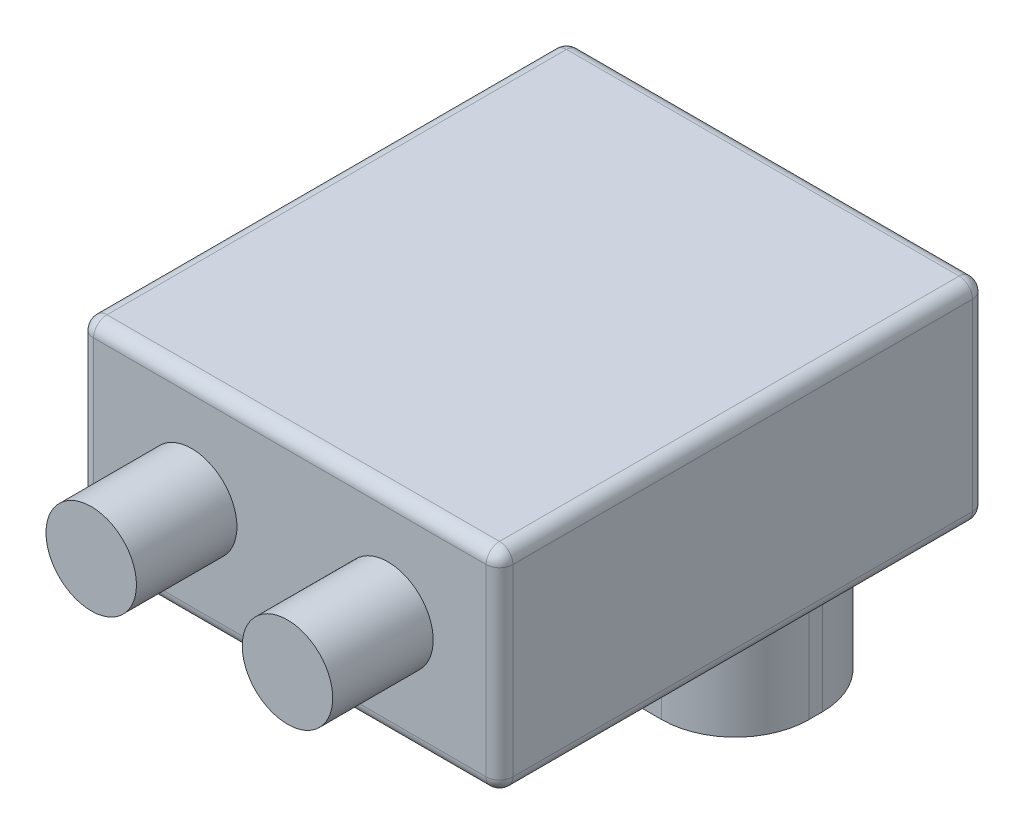
ISO-10303-21;
HEADER;
FILE_DESCRIPTION(('STEP AP214'),'2;1');
FILE_NAME('part.step','',(''),(''),'','','');
FILE_SCHEMA(('AUTOMOTIVE_DESIGN { 1 0 10303 214 1 1 1 1 }'));
ENDSEC;
DATA;
#1=APPLICATION_CONTEXT('core data for automotive mechanical design processes');
#2=APPLICATION_PROTOCOL_DEFINITION('international standard','automotive_design',2000,#1);
#3=PRODUCT_CONTEXT('',#1,'mechanical');
#4=PRODUCT('Part','Part','',(#3));
#5=PRODUCT_RELATED_PRODUCT_CATEGORY('part','',(#4));
#6=PRODUCT_DEFINITION_FORMATION('','',#4);
#7=PRODUCT_DEFINITION_CONTEXT('part definition',#1,'design');
#8=PRODUCT_DEFINITION('design','',#6,#7);
#9=PRODUCT_DEFINITION_SHAPE('','',#8);
#10=(LENGTH_UNIT() NAMED_UNIT(*) SI_UNIT(.MILLI.,.METRE.));
#11=(NAMED_UNIT(*) PLANE_ANGLE_UNIT() SI_UNIT($,.RADIAN.));
#12=(NAMED_UNIT(*) SI_UNIT($,.STERADIAN.) SOLID_ANGLE_UNIT());
#13=UNCERTAINTY_MEASURE_WITH_UNIT(LENGTH_MEASURE(1.E-05),#10,'distance_accuracy_value','');
#14=(GEOMETRIC_REPRESENTATION_CONTEXT(3) GLOBAL_UNCERTAINTY_ASSIGNED_CONTEXT((#13)) GLOBAL_UNIT_ASSIGNED_CONTEXT((#10,
#11,#12)) REPRESENTATION_CONTEXT('',''));
#15=CARTESIAN_POINT('',(0.,0.,0.));
#16=DIRECTION('',(0.,0.,1.));
#17=DIRECTION('',(1.,0.,0.));
#18=AXIS2_PLACEMENT_3D('',#15,#16,#17);
#19=CARTESIAN_POINT('',(0.,0.,0.));
#20=DIRECTION('',(0.,1.,0.));
#21=DIRECTION('',(0.,0.,1.));
#22=AXIS2_PLACEMENT_3D('',#19,#20,#21);
#23=PLANE('',#22);
#24=DIRECTION('',(-1.,0.,0.));
#25=VECTOR('',#24,1.);
#26=CARTESIAN_POINT('',(0.,0.,-34.3));
#27=LINE('',#26,#25);
#28=CARTESIAN_POINT('',(-29.3,0.,-34.3));
#29=VERTEX_POINT('',#28);
#30=CARTESIAN_POINT('',(29.3,0.,-34.3));
#31=VERTEX_POINT('',#30);
#32=EDGE_CURVE('E245',#29,#31,#27,.F.);
#33=ORIENTED_EDGE('',*,*,#32,.T.);
#34=DIRECTION('',(0.,0.,-1.));
#35=VECTOR('',#34,1.);
#36=CARTESIAN_POINT('',(29.3,0.,0.));
#37=LINE('',#36,#35);
#38=CARTESIAN_POINT('',(29.3,0.,34.3));
#39=VERTEX_POINT('',#38);
#40=EDGE_CURVE('E248',#31,#39,#37,.F.);
#41=ORIENTED_EDGE('',*,*,#40,.T.);
#42=DIRECTION('',(1.,0.,0.));
#43=VECTOR('',#42,1.);
#44=CARTESIAN_POINT('',(0.,0.,34.3));
#45=LINE('',#44,#43);
#46=CARTESIAN_POINT('',(-29.3,0.,34.3));
#47=VERTEX_POINT('',#46);
#48=EDGE_CURVE('E243',#39,#47,#45,.F.);
#49=ORIENTED_EDGE('',*,*,#48,.T.);
#50=DIRECTION('',(0.,0.,1.));
#51=VECTOR('',#50,1.);
#52=CARTESIAN_POINT('',(-29.3,0.,0.));
#53=LINE('',#52,#51);
#54=EDGE_CURVE('E241',#47,#29,#53,.F.);
#55=ORIENTED_EDGE('',*,*,#54,.T.);
#56=EDGE_LOOP('',(#33,#41,#49,#55));
#57=FACE_BOUND('',#56,.T.);
#58=DIRECTION('',(0.,0.,-1.));
#59=VECTOR('',#58,1.);
#60=CARTESIAN_POINT('',(-25.,0.,-5.2));
#61=LINE('',#60,#59);
#62=CARTESIAN_POINT('',(-25.,0.,-16.2));
#63=VERTEX_POINT('',#62);
#64=CARTESIAN_POINT('',(-25.,0.,-18.2));
#65=VERTEX_POINT('',#64);
#66=EDGE_CURVE('E317',#63,#65,#61,.T.);
#67=ORIENTED_EDGE('',*,*,#66,.F.);
#68=CARTESIAN_POINT('',(-14.,0.,-16.2));
#69=DIRECTION('',(0.,1.,0.));
#70=DIRECTION('',(0.,0.,1.));
#71=AXIS2_PLACEMENT_3D('',#68,#69,#70);
#72=CIRCLE('',#71,11.);
#73=CARTESIAN_POINT('',(-14.,0.,-5.2));
#74=VERTEX_POINT('',#73);
#75=EDGE_CURVE('E59',#63,#74,#72,.T.);
#76=ORIENTED_EDGE('',*,*,#75,.T.);
#77=DIRECTION('',(-1.,0.,0.));
#78=VECTOR('',#77,1.);
#79=CARTESIAN_POINT('',(-25.,0.,-5.2));
#80=LINE('',#79,#78);
#81=CARTESIAN_POINT('',(14.,0.,-5.2));
#82=VERTEX_POINT('',#81);
#83=EDGE_CURVE('E799',#82,#74,#80,.T.);
#84=ORIENTED_EDGE('',*,*,#83,.F.);
#85=CARTESIAN_POINT('',(14.,0.,-16.2));
#86=DIRECTION('',(0.,1.,0.));
#87=DIRECTION('',(0.,0.,1.));
#88=AXIS2_PLACEMENT_3D('',#85,#86,#87);
#89=CIRCLE('',#88,11.);
#90=CARTESIAN_POINT('',(25.,0.,-16.2));
#91=VERTEX_POINT('',#90);
#92=EDGE_CURVE('E344',#82,#91,#89,.T.);
#93=ORIENTED_EDGE('',*,*,#92,.T.);
#94=DIRECTION('',(0.,0.,1.));
#95=VECTOR('',#94,1.);
#96=CARTESIAN_POINT('',(25.,0.,-5.2));
#97=LINE('',#96,#95);
#98=CARTESIAN_POINT('',(25.,0.,-18.2));
#99=VERTEX_POINT('',#98);
#100=EDGE_CURVE('E806',#99,#91,#97,.T.);
#101=ORIENTED_EDGE('',*,*,#100,.F.);
#102=CARTESIAN_POINT('',(14.,0.,-18.2));
#103=DIRECTION('',(0.,1.,0.));
#104=DIRECTION('',(0.,0.,1.));
#105=AXIS2_PLACEMENT_3D('',#102,#103,#104);
#106=CIRCLE('',#105,11.);
#107=CARTESIAN_POINT('',(14.,0.,-29.2));
#108=VERTEX_POINT('',#107);
#109=EDGE_CURVE('E346',#99,#108,#106,.T.);
#110=ORIENTED_EDGE('',*,*,#109,.T.);
#111=DIRECTION('',(1.,0.,0.));
#112=VECTOR('',#111,1.);
#113=CARTESIAN_POINT('',(-25.,0.,-29.2));
#114=LINE('',#113,#112);
#115=CARTESIAN_POINT('',(-14.,0.,-29.2));
#116=VERTEX_POINT('',#115);
#117=EDGE_CURVE('E784',#116,#108,#114,.T.);
#118=ORIENTED_EDGE('',*,*,#117,.F.);
#119=CARTESIAN_POINT('',(-14.,0.,-18.2));
#120=DIRECTION('',(0.,1.,0.));
#121=DIRECTION('',(0.,0.,1.));
#122=AXIS2_PLACEMENT_3D('',#119,#120,#121);
#123=CIRCLE('',#122,11.);
#124=EDGE_CURVE('E51',#116,#65,#123,.T.);
#125=ORIENTED_EDGE('',*,*,#124,.T.);
#126=EDGE_LOOP('',(#67,#76,#84,#93,#101,#110,#118,#125));
#127=FACE_BOUND('',#126,.T.);
#128=ADVANCED_FACE('F36',(#57,#127),#23,.F.);
#129=CARTESIAN_POINT('',(31.3,24.14,-36.3));
#130=DIRECTION('',(-1.,0.,0.));
#131=DIRECTION('',(0.,0.,1.));
#132=AXIS2_PLACEMENT_3D('',#129,#130,#131);
#133=PLANE('',#132);
#134=DIRECTION('',(0.,-1.,0.));
#135=VECTOR('',#134,1.);
#136=CARTESIAN_POINT('',(31.3,24.14,34.3));
#137=LINE('',#136,#135);
#138=CARTESIAN_POINT('',(31.3,29.44,34.3));
#139=VERTEX_POINT('',#138);
#140=CARTESIAN_POINT('',(31.3,2.,34.3));
#141=VERTEX_POINT('',#140);
#142=EDGE_CURVE('E214',#139,#141,#137,.T.);
#143=ORIENTED_EDGE('',*,*,#142,.T.);
#144=DIRECTION('',(0.,0.,-1.));
#145=VECTOR('',#144,1.);
#146=CARTESIAN_POINT('',(31.3,2.,-36.3));
#147=LINE('',#146,#145);
#148=CARTESIAN_POINT('',(31.3,2.,-34.3));
#149=VERTEX_POINT('',#148);
#150=EDGE_CURVE('E221',#141,#149,#147,.T.);
#151=ORIENTED_EDGE('',*,*,#150,.T.);
#152=DIRECTION('',(0.,-1.,0.));
#153=VECTOR('',#152,1.);
#154=CARTESIAN_POINT('',(31.3,24.14,-34.3));
#155=LINE('',#154,#153);
#156=CARTESIAN_POINT('',(31.3,29.44,-34.3));
#157=VERTEX_POINT('',#156);
#158=EDGE_CURVE('E182',#149,#157,#155,.F.);
#159=ORIENTED_EDGE('',*,*,#158,.T.);
#160=DIRECTION('',(0.,0.,-1.));
#161=VECTOR('',#160,1.);
#162=CARTESIAN_POINT('',(31.3,29.44,36.3));
#163=LINE('',#162,#161);
#164=EDGE_CURVE('E212',#157,#139,#163,.F.);
#165=ORIENTED_EDGE('',*,*,#164,.T.);
#166=EDGE_LOOP('',(#143,#151,#159,#165));
#167=FACE_BOUND('',#166,.T.);
#168=ADVANCED_FACE('F438',(#167),#133,.F.);
#169=CARTESIAN_POINT('',(-31.3,24.14,-36.3));
#170=DIRECTION('',(0.,0.,1.));
#171=DIRECTION('',(1.,0.,0.));
#172=AXIS2_PLACEMENT_3D('',#169,#170,#171);
#173=PLANE('',#172);
#174=DIRECTION('',(-1.,0.,0.));
#175=VECTOR('',#174,1.);
#176=CARTESIAN_POINT('',(31.3,29.44,-36.3));
#177=LINE('',#176,#175);
#178=CARTESIAN_POINT('',(-29.3,29.44,-36.3));
#179=VERTEX_POINT('',#178);
#180=CARTESIAN_POINT('',(29.3,29.44,-36.3));
#181=VERTEX_POINT('',#180);
#182=EDGE_CURVE('E210',#179,#181,#177,.F.);
#183=ORIENTED_EDGE('',*,*,#182,.T.);
#184=DIRECTION('',(0.,-1.,0.));
#185=VECTOR('',#184,1.);
#186=CARTESIAN_POINT('',(29.3,24.14,-36.3));
#187=LINE('',#186,#185);
#188=CARTESIAN_POINT('',(29.3,2.,-36.3));
#189=VERTEX_POINT('',#188);
#190=EDGE_CURVE('E180',#181,#189,#187,.T.);
#191=ORIENTED_EDGE('',*,*,#190,.T.);
#192=DIRECTION('',(-1.,0.,0.));
#193=VECTOR('',#192,1.);
#194=CARTESIAN_POINT('',(-31.3,2.,-36.3));
#195=LINE('',#194,#193);
#196=CARTESIAN_POINT('',(-29.3,2.,-36.3));
#197=VERTEX_POINT('',#196);
#198=EDGE_CURVE('E199',#189,#197,#195,.T.);
#199=ORIENTED_EDGE('',*,*,#198,.T.);
#200=DIRECTION('',(0.,-1.,0.));
#201=VECTOR('',#200,1.);
#202=CARTESIAN_POINT('',(-29.3,24.14,-36.3));
#203=LINE('',#202,#201);
#204=EDGE_CURVE('E205',#197,#179,#203,.F.);
#205=ORIENTED_EDGE('',*,*,#204,.T.);
#206=EDGE_LOOP('',(#183,#191,#199,#205));
#207=FACE_BOUND('',#206,.T.);
#208=ADVANCED_FACE('F208',(#207),#173,.F.);
#209=CARTESIAN_POINT('',(-31.3,24.14,-36.3));
#210=DIRECTION('',(1.,0.,0.));
#211=DIRECTION('',(0.,0.,-1.));
#212=AXIS2_PLACEMENT_3D('',#209,#210,#211);
#213=PLANE('',#212);
#214=DIRECTION('',(0.,-1.,0.));
#215=VECTOR('',#214,1.);
#216=CARTESIAN_POINT('',(-31.3,24.14,-34.3));
#217=LINE('',#216,#215);
#218=CARTESIAN_POINT('',(-31.3,29.44,-34.3));
#219=VERTEX_POINT('',#218);
#220=CARTESIAN_POINT('',(-31.3,2.,-34.3));
#221=VERTEX_POINT('',#220);
#222=EDGE_CURVE('E236',#219,#221,#217,.T.);
#223=ORIENTED_EDGE('',*,*,#222,.T.);
#224=DIRECTION('',(0.,0.,1.));
#225=VECTOR('',#224,1.);
#226=CARTESIAN_POINT('',(-31.3,2.,-36.3));
#227=LINE('',#226,#225);
#228=CARTESIAN_POINT('',(-31.3,2.,34.3));
#229=VERTEX_POINT('',#228);
#230=EDGE_CURVE('E239',#221,#229,#227,.T.);
#231=ORIENTED_EDGE('',*,*,#230,.T.);
#232=DIRECTION('',(0.,-1.,0.));
#233=VECTOR('',#232,1.);
#234=CARTESIAN_POINT('',(-31.3,24.14,34.3));
#235=LINE('',#234,#233);
#236=CARTESIAN_POINT('',(-31.3,29.44,34.3));
#237=VERTEX_POINT('',#236);
#238=EDGE_CURVE('E234',#229,#237,#235,.F.);
#239=ORIENTED_EDGE('',*,*,#238,.T.);
#240=DIRECTION('',(0.,0.,1.));
#241=VECTOR('',#240,1.);
#242=CARTESIAN_POINT('',(-31.3,29.44,-36.3));
#243=LINE('',#242,#241);
#244=EDGE_CURVE('E232',#237,#219,#243,.F.);
#245=ORIENTED_EDGE('',*,*,#244,.T.);
#246=EDGE_LOOP('',(#223,#231,#239,#245));
#247=FACE_BOUND('',#246,.T.);
#248=ADVANCED_FACE('F358',(#247),#213,.F.);
#249=CARTESIAN_POINT('',(-31.3,24.14,36.3));
#250=DIRECTION('',(0.,0.,-1.));
#251=DIRECTION('',(-1.,0.,0.));
#252=AXIS2_PLACEMENT_3D('',#249,#250,#251);
#253=PLANE('',#252);
#254=CARTESIAN_POINT('',(14.64999991,15.7200005,36.3));
#255=DIRECTION('',(0.,0.,-1.));
#256=DIRECTION('',(-1.,0.,0.));
#257=AXIS2_PLACEMENT_3D('',#254,#255,#256);
#258=CIRCLE('',#257,6.75);
#259=CARTESIAN_POINT('',(7.89999991,15.7200005,36.3));
#260=VERTEX_POINT('',#259);
#261=EDGE_CURVE('E11',#260,#260,#258,.F.);
#262=ORIENTED_EDGE('',*,*,#261,.F.);
#263=EDGE_LOOP('',(#262));
#264=FACE_BOUND('',#263,.T.);
#265=CARTESIAN_POINT('',(-14.64999991,15.7200005,36.3));
#266=DIRECTION('',(0.,0.,-1.));
#267=DIRECTION('',(-1.,0.,0.));
#268=AXIS2_PLACEMENT_3D('',#265,#266,#267);
#269=CIRCLE('',#268,6.75);
#270=CARTESIAN_POINT('',(-21.39999991,15.7200005,36.3));
#271=VERTEX_POINT('',#270);
#272=EDGE_CURVE('E44',#271,#271,#269,.F.);
#273=ORIENTED_EDGE('',*,*,#272,.F.);
#274=EDGE_LOOP('',(#273));
#275=FACE_BOUND('',#274,.T.);
#276=DIRECTION('',(1.,0.,0.));
#277=VECTOR('',#276,1.);
#278=CARTESIAN_POINT('',(-31.3,29.44,36.3));
#279=LINE('',#278,#277);
#280=CARTESIAN_POINT('',(29.3,29.44,36.3));
#281=VERTEX_POINT('',#280);
#282=CARTESIAN_POINT('',(-29.3,29.44,36.3));
#283=VERTEX_POINT('',#282);
#284=EDGE_CURVE('E254',#281,#283,#279,.F.);
#285=ORIENTED_EDGE('',*,*,#284,.T.);
#286=DIRECTION('',(0.,-1.,0.));
#287=VECTOR('',#286,1.);
#288=CARTESIAN_POINT('',(-29.3,24.14,36.3));
#289=LINE('',#288,#287);
#290=CARTESIAN_POINT('',(-29.3,2.,36.3));
#291=VERTEX_POINT('',#290);
#292=EDGE_CURVE('E256',#283,#291,#289,.T.);
#293=ORIENTED_EDGE('',*,*,#292,.T.);
#294=DIRECTION('',(1.,0.,0.));
#295=VECTOR('',#294,1.);
#296=CARTESIAN_POINT('',(-31.3,2.,36.3));
#297=LINE('',#296,#295);
#298=CARTESIAN_POINT('',(29.3,2.,36.3));
#299=VERTEX_POINT('',#298);
#300=EDGE_CURVE('E250',#291,#299,#297,.T.);
#301=ORIENTED_EDGE('',*,*,#300,.T.);
#302=DIRECTION('',(0.,-1.,0.));
#303=VECTOR('',#302,1.);
#304=CARTESIAN_POINT('',(29.3,24.14,36.3));
#305=LINE('',#304,#303);
#306=EDGE_CURVE('E252',#299,#281,#305,.F.);
#307=ORIENTED_EDGE('',*,*,#306,.T.);
#308=EDGE_LOOP('',(#285,#293,#301,#307));
#309=FACE_BOUND('',#308,.T.);
#310=ADVANCED_FACE('F354',(#264,#275,#309),#253,.F.);
#311=CARTESIAN_POINT('',(-25.,-19.,-5.2));
#312=DIRECTION('',(1.,0.,0.));
#313=DIRECTION('',(0.,0.,-1.));
#314=AXIS2_PLACEMENT_3D('',#311,#312,#313);
#315=PLANE('',#314);
#316=ORIENTED_EDGE('',*,*,#66,.T.);
#317=DIRECTION('',(0.,1.,0.));
#318=VECTOR('',#317,1.);
#319=CARTESIAN_POINT('',(-25.,-19.,-18.2));
#320=LINE('',#319,#318);
#321=CARTESIAN_POINT('',(-25.,-19.,-18.2));
#322=VERTEX_POINT('',#321);
#323=EDGE_CURVE('E342',#65,#322,#320,.F.);
#324=ORIENTED_EDGE('',*,*,#323,.T.);
#325=DIRECTION('',(0.,0.,-1.));
#326=VECTOR('',#325,1.);
#327=CARTESIAN_POINT('',(-25.,-19.,-5.2));
#328=LINE('',#327,#326);
#329=CARTESIAN_POINT('',(-25.,-19.,-16.2));
#330=VERTEX_POINT('',#329);
#331=EDGE_CURVE('E793',#330,#322,#328,.T.);
#332=ORIENTED_EDGE('',*,*,#331,.F.);
#333=DIRECTION('',(0.,1.,0.));
#334=VECTOR('',#333,1.);
#335=CARTESIAN_POINT('',(-25.,-19.,-16.2));
#336=LINE('',#335,#334);
#337=EDGE_CURVE('E340',#330,#63,#336,.T.);
#338=ORIENTED_EDGE('',*,*,#337,.T.);
#339=EDGE_LOOP('',(#316,#324,#332,#338));
#340=FACE_BOUND('',#339,.T.);
#341=ADVANCED_FACE('F357',(#340),#315,.F.);
#342=CARTESIAN_POINT('',(-25.,-19.,-29.2));
#343=DIRECTION('',(0.,0.,1.));
#344=DIRECTION('',(1.,0.,0.));
#345=AXIS2_PLACEMENT_3D('',#342,#343,#344);
#346=PLANE('',#345);
#347=ORIENTED_EDGE('',*,*,#117,.T.);
#348=DIRECTION('',(0.,1.,0.));
#349=VECTOR('',#348,1.);
#350=CARTESIAN_POINT('',(14.,-19.,-29.2));
#351=LINE('',#350,#349);
#352=CARTESIAN_POINT('',(14.,-19.,-29.2));
#353=VERTEX_POINT('',#352);
#354=EDGE_CURVE('E338',#108,#353,#351,.F.);
#355=ORIENTED_EDGE('',*,*,#354,.T.);
#356=DIRECTION('',(1.,0.,0.));
#357=VECTOR('',#356,1.);
#358=CARTESIAN_POINT('',(-25.,-19.,-29.2));
#359=LINE('',#358,#357);
#360=CARTESIAN_POINT('',(-14.,-19.,-29.2));
#361=VERTEX_POINT('',#360);
#362=EDGE_CURVE('E791',#361,#353,#359,.T.);
#363=ORIENTED_EDGE('',*,*,#362,.F.);
#364=DIRECTION('',(0.,1.,0.));
#365=VECTOR('',#364,1.);
#366=CARTESIAN_POINT('',(-14.,-19.,-29.2));
#367=LINE('',#366,#365);
#368=EDGE_CURVE('E335',#361,#116,#367,.T.);
#369=ORIENTED_EDGE('',*,*,#368,.T.);
#370=EDGE_LOOP('',(#347,#355,#363,#369));
#371=FACE_BOUND('',#370,.T.);
#372=ADVANCED_FACE('F744',(#371),#346,.F.);
#373=CARTESIAN_POINT('',(25.,-19.,-5.2));
#374=DIRECTION('',(-1.,0.,0.));
#375=DIRECTION('',(0.,0.,1.));
#376=AXIS2_PLACEMENT_3D('',#373,#374,#375);
#377=PLANE('',#376);
#378=ORIENTED_EDGE('',*,*,#100,.T.);
#379=DIRECTION('',(0.,1.,0.));
#380=VECTOR('',#379,1.);
#381=CARTESIAN_POINT('',(25.,-19.,-16.2));
#382=LINE('',#381,#380);
#383=CARTESIAN_POINT('',(25.,-19.,-16.2));
#384=VERTEX_POINT('',#383);
#385=EDGE_CURVE('E325',#91,#384,#382,.F.);
#386=ORIENTED_EDGE('',*,*,#385,.T.);
#387=DIRECTION('',(0.,0.,1.));
#388=VECTOR('',#387,1.);
#389=CARTESIAN_POINT('',(25.,-19.,-5.2));
#390=LINE('',#389,#388);
#391=CARTESIAN_POINT('',(25.,-19.,-18.2));
#392=VERTEX_POINT('',#391);
#393=EDGE_CURVE('E796',#392,#384,#390,.T.);
#394=ORIENTED_EDGE('',*,*,#393,.F.);
#395=DIRECTION('',(0.,1.,0.));
#396=VECTOR('',#395,1.);
#397=CARTESIAN_POINT('',(25.,-19.,-18.2));
#398=LINE('',#397,#396);
#399=EDGE_CURVE('E322',#392,#99,#398,.T.);
#400=ORIENTED_EDGE('',*,*,#399,.T.);
#401=EDGE_LOOP('',(#378,#386,#394,#400));
#402=FACE_BOUND('',#401,.T.);
#403=ADVANCED_FACE('F735',(#402),#377,.F.);
#404=CARTESIAN_POINT('',(-25.,-19.,-5.2));
#405=DIRECTION('',(0.,0.,-1.));
#406=DIRECTION('',(-1.,0.,0.));
#407=AXIS2_PLACEMENT_3D('',#404,#405,#406);
#408=PLANE('',#407);
#409=DIRECTION('',(-1.,0.,0.));
#410=VECTOR('',#409,1.);
#411=CARTESIAN_POINT('',(-25.,-19.,-5.2));
#412=LINE('',#411,#410);
#413=CARTESIAN_POINT('',(14.,-19.,-5.2));
#414=VERTEX_POINT('',#413);
#415=CARTESIAN_POINT('',(-14.,-19.,-5.2));
#416=VERTEX_POINT('',#415);
#417=EDGE_CURVE('E206',#414,#416,#412,.T.);
#418=ORIENTED_EDGE('',*,*,#417,.F.);
#419=DIRECTION('',(0.,1.,0.));
#420=VECTOR('',#419,1.);
#421=CARTESIAN_POINT('',(14.,-19.,-5.2));
#422=LINE('',#421,#420);
#423=EDGE_CURVE('E319',#414,#82,#422,.T.);
#424=ORIENTED_EDGE('',*,*,#423,.T.);
#425=ORIENTED_EDGE('',*,*,#83,.T.);
#426=DIRECTION('',(0.,1.,0.));
#427=VECTOR('',#426,1.);
#428=CARTESIAN_POINT('',(-14.,-19.,-5.2));
#429=LINE('',#428,#427);
#430=EDGE_CURVE('E258',#74,#416,#429,.F.);
#431=ORIENTED_EDGE('',*,*,#430,.T.);
#432=EDGE_LOOP('',(#418,#424,#425,#431));
#433=FACE_BOUND('',#432,.T.);
#434=ADVANCED_FACE('F726',(#433),#408,.F.);
#435=CARTESIAN_POINT('',(0.,-19.,0.));
#436=DIRECTION('',(0.,-1.,0.));
#437=DIRECTION('',(0.,0.,-1.));
#438=AXIS2_PLACEMENT_3D('',#435,#436,#437);
#439=PLANE('',#438);
#440=ORIENTED_EDGE('',*,*,#393,.T.);
#441=CARTESIAN_POINT('',(14.,-19.,-16.2));
#442=DIRECTION('',(0.,-1.,0.));
#443=DIRECTION('',(0.,0.,-1.));
#444=AXIS2_PLACEMENT_3D('',#441,#442,#443);
#445=CIRCLE('',#444,11.);
#446=EDGE_CURVE('E333',#384,#414,#445,.T.);
#447=ORIENTED_EDGE('',*,*,#446,.T.);
#448=ORIENTED_EDGE('',*,*,#417,.T.);
#449=CARTESIAN_POINT('',(-14.,-19.,-16.2));
#450=DIRECTION('',(0.,-1.,0.));
#451=DIRECTION('',(0.,0.,-1.));
#452=AXIS2_PLACEMENT_3D('',#449,#450,#451);
#453=CIRCLE('',#452,11.);
#454=EDGE_CURVE('E327',#416,#330,#453,.T.);
#455=ORIENTED_EDGE('',*,*,#454,.T.);
#456=ORIENTED_EDGE('',*,*,#331,.T.);
#457=CARTESIAN_POINT('',(-14.,-19.,-18.2));
#458=DIRECTION('',(0.,-1.,0.));
#459=DIRECTION('',(0.,0.,-1.));
#460=AXIS2_PLACEMENT_3D('',#457,#458,#459);
#461=CIRCLE('',#460,11.);
#462=EDGE_CURVE('E329',#322,#361,#461,.T.);
#463=ORIENTED_EDGE('',*,*,#462,.T.);
#464=ORIENTED_EDGE('',*,*,#362,.T.);
#465=CARTESIAN_POINT('',(14.,-19.,-18.2));
#466=DIRECTION('',(0.,-1.,0.));
#467=DIRECTION('',(0.,0.,-1.));
#468=AXIS2_PLACEMENT_3D('',#465,#466,#467);
#469=CIRCLE('',#468,11.);
#470=EDGE_CURVE('E331',#353,#392,#469,.T.);
#471=ORIENTED_EDGE('',*,*,#470,.T.);
#472=EDGE_LOOP('',(#440,#447,#448,#455,#456,#463,#464,#471));
#473=FACE_BOUND('',#472,.T.);
#474=ADVANCED_FACE('F693',(#473),#439,.T.);
#475=CARTESIAN_POINT('',(0.,31.44,0.));
#476=DIRECTION('',(0.,1.,0.));
#477=DIRECTION('',(0.,0.,1.));
#478=AXIS2_PLACEMENT_3D('',#475,#476,#477);
#479=PLANE('',#478);
#480=DIRECTION('',(1.,0.,0.));
#481=VECTOR('',#480,1.);
#482=CARTESIAN_POINT('',(31.3,31.44,34.3));
#483=LINE('',#482,#481);
#484=CARTESIAN_POINT('',(-29.3,31.44,34.3));
#485=VERTEX_POINT('',#484);
#486=CARTESIAN_POINT('',(29.3,31.44,34.3));
#487=VERTEX_POINT('',#486);
#488=EDGE_CURVE('E225',#485,#487,#483,.T.);
#489=ORIENTED_EDGE('',*,*,#488,.T.);
#490=DIRECTION('',(0.,0.,-1.));
#491=VECTOR('',#490,1.);
#492=CARTESIAN_POINT('',(29.3,31.44,-36.3));
#493=LINE('',#492,#491);
#494=CARTESIAN_POINT('',(29.3,31.44,-34.3));
#495=VERTEX_POINT('',#494);
#496=EDGE_CURVE('E230',#487,#495,#493,.T.);
#497=ORIENTED_EDGE('',*,*,#496,.T.);
#498=DIRECTION('',(-1.,0.,0.));
#499=VECTOR('',#498,1.);
#500=CARTESIAN_POINT('',(-31.3,31.44,-34.3));
#501=LINE('',#500,#499);
#502=CARTESIAN_POINT('',(-29.3,31.44,-34.3));
#503=VERTEX_POINT('',#502);
#504=EDGE_CURVE('E227',#495,#503,#501,.T.);
#505=ORIENTED_EDGE('',*,*,#504,.T.);
#506=DIRECTION('',(0.,0.,1.));
#507=VECTOR('',#506,1.);
#508=CARTESIAN_POINT('',(-29.3,31.44,36.3));
#509=LINE('',#508,#507);
#510=EDGE_CURVE('E223',#503,#485,#509,.T.);
#511=ORIENTED_EDGE('',*,*,#510,.T.);
#512=EDGE_LOOP('',(#489,#497,#505,#511));
#513=FACE_BOUND('',#512,.T.);
#514=ADVANCED_FACE('F381',(#513),#479,.T.);
#515=CARTESIAN_POINT('',(-29.3,24.14,34.3));
#516=DIRECTION('',(0.,-1.,0.));
#517=DIRECTION('',(0.,0.,-1.));
#518=AXIS2_PLACEMENT_3D('',#515,#516,#517);
#519=CYLINDRICAL_SURFACE('',#518,2.);
#520=CARTESIAN_POINT('',(-29.3,29.44,34.3));
#521=DIRECTION('',(0.,1.,0.));
#522=DIRECTION('',(0.,0.,1.));
#523=AXIS2_PLACEMENT_3D('',#520,#521,#522);
#524=CIRCLE('',#523,2.);
#525=EDGE_CURVE('E314',#237,#283,#524,.T.);
#526=ORIENTED_EDGE('',*,*,#525,.F.);
#527=ORIENTED_EDGE('',*,*,#238,.F.);
#528=CARTESIAN_POINT('',(-29.3,2.,34.3));
#529=DIRECTION('',(0.,-1.,0.));
#530=DIRECTION('',(0.,0.,-1.));
#531=AXIS2_PLACEMENT_3D('',#528,#529,#530);
#532=CIRCLE('',#531,2.);
#533=EDGE_CURVE('E311',#291,#229,#532,.T.);
#534=ORIENTED_EDGE('',*,*,#533,.F.);
#535=ORIENTED_EDGE('',*,*,#292,.F.);
#536=EDGE_LOOP('',(#526,#527,#534,#535));
#537=FACE_BOUND('',#536,.T.);
#538=ADVANCED_FACE('F370',(#537),#519,.T.);
#539=CARTESIAN_POINT('',(-29.3,29.44,34.3));
#540=DIRECTION('',(0.,0.,1.));
#541=DIRECTION('',(1.,0.,0.));
#542=AXIS2_PLACEMENT_3D('',#539,#540,#541);
#543=SPHERICAL_SURFACE('',#542,2.);
#544=CARTESIAN_POINT('',(-29.3,29.44,34.3));
#545=DIRECTION('',(0.,0.,1.));
#546=DIRECTION('',(1.,0.,0.));
#547=AXIS2_PLACEMENT_3D('',#544,#545,#546);
#548=CIRCLE('',#547,2.);
#549=EDGE_CURVE('E305',#237,#485,#548,.F.);
#550=ORIENTED_EDGE('',*,*,#549,.F.);
#551=ORIENTED_EDGE('',*,*,#525,.T.);
#552=CARTESIAN_POINT('',(-29.3,29.44,34.3));
#553=DIRECTION('',(-1.,0.,0.));
#554=DIRECTION('',(0.,0.,1.));
#555=AXIS2_PLACEMENT_3D('',#552,#553,#554);
#556=CIRCLE('',#555,2.);
#557=EDGE_CURVE('E308',#485,#283,#556,.F.);
#558=ORIENTED_EDGE('',*,*,#557,.F.);
#559=EDGE_LOOP('',(#550,#551,#558));
#560=FACE_BOUND('',#559,.T.);
#561=ADVANCED_FACE('F375',(#560),#543,.T.);
#562=CARTESIAN_POINT('',(-29.3,2.,34.3));
#563=DIRECTION('',(-1.,0.,0.));
#564=DIRECTION('',(0.,-1.,0.));
#565=AXIS2_PLACEMENT_3D('',#562,#563,#564);
#566=SPHERICAL_SURFACE('',#565,2.);
#567=CARTESIAN_POINT('',(-29.3,2.,34.3));
#568=DIRECTION('',(-1.,0.,0.));
#569=DIRECTION('',(0.,0.,1.));
#570=AXIS2_PLACEMENT_3D('',#567,#568,#569);
#571=CIRCLE('',#570,2.);
#572=EDGE_CURVE('E299',#291,#47,#571,.F.);
#573=ORIENTED_EDGE('',*,*,#572,.F.);
#574=ORIENTED_EDGE('',*,*,#533,.T.);
#575=CARTESIAN_POINT('',(-29.3,2.,34.3));
#576=DIRECTION('',(0.,0.,1.));
#577=DIRECTION('',(1.,0.,0.));
#578=AXIS2_PLACEMENT_3D('',#575,#576,#577);
#579=CIRCLE('',#578,2.);
#580=EDGE_CURVE('E302',#47,#229,#579,.F.);
#581=ORIENTED_EDGE('',*,*,#580,.F.);
#582=EDGE_LOOP('',(#573,#574,#581));
#583=FACE_BOUND('',#582,.T.);
#584=ADVANCED_FACE('F404',(#583),#566,.T.);
#585=CARTESIAN_POINT('',(0.,29.44,34.3));
#586=DIRECTION('',(-1.,0.,0.));
#587=DIRECTION('',(0.,0.,1.));
#588=AXIS2_PLACEMENT_3D('',#585,#586,#587);
#589=CYLINDRICAL_SURFACE('',#588,2.);
#590=ORIENTED_EDGE('',*,*,#557,.T.);
#591=ORIENTED_EDGE('',*,*,#284,.F.);
#592=CARTESIAN_POINT('',(29.3,29.44,34.3));
#593=DIRECTION('',(1.,0.,0.));
#594=DIRECTION('',(0.,0.,-1.));
#595=AXIS2_PLACEMENT_3D('',#592,#593,#594);
#596=CIRCLE('',#595,2.);
#597=EDGE_CURVE('E293',#487,#281,#596,.T.);
#598=ORIENTED_EDGE('',*,*,#597,.F.);
#599=ORIENTED_EDGE('',*,*,#488,.F.);
#600=EDGE_LOOP('',(#590,#591,#598,#599));
#601=FACE_BOUND('',#600,.T.);
#602=ADVANCED_FACE('F378',(#601),#589,.T.);
#603=CARTESIAN_POINT('',(-29.3,29.44,0.));
#604=DIRECTION('',(0.,0.,-1.));
#605=DIRECTION('',(-1.,0.,0.));
#606=AXIS2_PLACEMENT_3D('',#603,#604,#605);
#607=CYLINDRICAL_SURFACE('',#606,2.);
#608=ORIENTED_EDGE('',*,*,#549,.T.);
#609=ORIENTED_EDGE('',*,*,#510,.F.);
#610=CARTESIAN_POINT('',(-29.3,29.44,-34.3));
#611=DIRECTION('',(0.,0.,-1.));
#612=DIRECTION('',(-1.,0.,0.));
#613=AXIS2_PLACEMENT_3D('',#610,#611,#612);
#614=CIRCLE('',#613,2.);
#615=EDGE_CURVE('E290',#219,#503,#614,.T.);
#616=ORIENTED_EDGE('',*,*,#615,.F.);
#617=ORIENTED_EDGE('',*,*,#244,.F.);
#618=EDGE_LOOP('',(#608,#609,#616,#617));
#619=FACE_BOUND('',#618,.T.);
#620=ADVANCED_FACE('F387',(#619),#607,.T.);
#621=CARTESIAN_POINT('',(-29.3,24.14,-34.3));
#622=DIRECTION('',(0.,-1.,0.));
#623=DIRECTION('',(0.,0.,-1.));
#624=AXIS2_PLACEMENT_3D('',#621,#622,#623);
#625=CYLINDRICAL_SURFACE('',#624,2.);
#626=CARTESIAN_POINT('',(-29.3,2.,-34.3));
#627=DIRECTION('',(0.,-1.,0.));
#628=DIRECTION('',(0.,0.,-1.));
#629=AXIS2_PLACEMENT_3D('',#626,#627,#628);
#630=CIRCLE('',#629,2.);
#631=EDGE_CURVE('E284',#221,#197,#630,.T.);
#632=ORIENTED_EDGE('',*,*,#631,.F.);
#633=ORIENTED_EDGE('',*,*,#222,.F.);
#634=CARTESIAN_POINT('',(-29.3,29.44,-34.3));
#635=DIRECTION('',(0.,1.,0.));
#636=DIRECTION('',(0.,0.,1.));
#637=AXIS2_PLACEMENT_3D('',#634,#635,#636);
#638=CIRCLE('',#637,2.);
#639=EDGE_CURVE('E287',#179,#219,#638,.T.);
#640=ORIENTED_EDGE('',*,*,#639,.F.);
#641=ORIENTED_EDGE('',*,*,#204,.F.);
#642=EDGE_LOOP('',(#632,#633,#640,#641));
#643=FACE_BOUND('',#642,.T.);
#644=ADVANCED_FACE('F393',(#643),#625,.T.);
#645=CARTESIAN_POINT('',(-29.3,2.,-36.3));
#646=DIRECTION('',(0.,0.,1.));
#647=DIRECTION('',(1.,0.,0.));
#648=AXIS2_PLACEMENT_3D('',#645,#646,#647);
#649=CYLINDRICAL_SURFACE('',#648,2.);
#650=ORIENTED_EDGE('',*,*,#580,.T.);
#651=ORIENTED_EDGE('',*,*,#230,.F.);
#652=CARTESIAN_POINT('',(-29.3,2.,-34.3));
#653=DIRECTION('',(0.,0.,-1.));
#654=DIRECTION('',(-1.,0.,0.));
#655=AXIS2_PLACEMENT_3D('',#652,#653,#654);
#656=CIRCLE('',#655,2.);
#657=EDGE_CURVE('E282',#29,#221,#656,.T.);
#658=ORIENTED_EDGE('',*,*,#657,.F.);
#659=ORIENTED_EDGE('',*,*,#54,.F.);
#660=EDGE_LOOP('',(#650,#651,#658,#659));
#661=FACE_BOUND('',#660,.T.);
#662=ADVANCED_FACE('F399',(#661),#649,.T.);
#663=CARTESIAN_POINT('',(-31.3,2.,34.3));
#664=DIRECTION('',(1.,0.,0.));
#665=DIRECTION('',(0.,0.,-1.));
#666=AXIS2_PLACEMENT_3D('',#663,#664,#665);
#667=CYLINDRICAL_SURFACE('',#666,2.);
#668=ORIENTED_EDGE('',*,*,#572,.T.);
#669=ORIENTED_EDGE('',*,*,#48,.F.);
#670=CARTESIAN_POINT('',(29.3,2.,34.3));
#671=DIRECTION('',(1.,0.,0.));
#672=DIRECTION('',(0.,0.,-1.));
#673=AXIS2_PLACEMENT_3D('',#670,#671,#672);
#674=CIRCLE('',#673,2.);
#675=EDGE_CURVE('E279',#299,#39,#674,.T.);
#676=ORIENTED_EDGE('',*,*,#675,.F.);
#677=ORIENTED_EDGE('',*,*,#300,.F.);
#678=EDGE_LOOP('',(#668,#669,#676,#677));
#679=FACE_BOUND('',#678,.T.);
#680=ADVANCED_FACE('F407',(#679),#667,.T.);
#681=CARTESIAN_POINT('',(29.3,24.14,34.3));
#682=DIRECTION('',(0.,-1.,0.));
#683=DIRECTION('',(0.,0.,-1.));
#684=AXIS2_PLACEMENT_3D('',#681,#682,#683);
#685=CYLINDRICAL_SURFACE('',#684,2.);
#686=CARTESIAN_POINT('',(29.3,29.44,34.3));
#687=DIRECTION('',(0.,1.,0.));
#688=DIRECTION('',(0.,0.,1.));
#689=AXIS2_PLACEMENT_3D('',#686,#687,#688);
#690=CIRCLE('',#689,2.);
#691=EDGE_CURVE('E296',#281,#139,#690,.T.);
#692=ORIENTED_EDGE('',*,*,#691,.F.);
#693=ORIENTED_EDGE('',*,*,#306,.F.);
#694=CARTESIAN_POINT('',(29.3,2.,34.3));
#695=DIRECTION('',(0.,-1.,0.));
#696=DIRECTION('',(0.,0.,-1.));
#697=AXIS2_PLACEMENT_3D('',#694,#695,#696);
#698=CIRCLE('',#697,2.);
#699=EDGE_CURVE('E276',#141,#299,#698,.T.);
#700=ORIENTED_EDGE('',*,*,#699,.F.);
#701=ORIENTED_EDGE('',*,*,#142,.F.);
#702=EDGE_LOOP('',(#692,#693,#700,#701));
#703=FACE_BOUND('',#702,.T.);
#704=ADVANCED_FACE('F411',(#703),#685,.T.);
#705=CARTESIAN_POINT('',(29.3,29.44,34.3));
#706=DIRECTION('',(0.,0.,1.));
#707=DIRECTION('',(1.,0.,0.));
#708=AXIS2_PLACEMENT_3D('',#705,#706,#707);
#709=SPHERICAL_SURFACE('',#708,2.);
#710=ORIENTED_EDGE('',*,*,#597,.T.);
#711=ORIENTED_EDGE('',*,*,#691,.T.);
#712=CARTESIAN_POINT('',(29.3,29.44,34.3));
#713=DIRECTION('',(0.,0.,1.));
#714=DIRECTION('',(1.,0.,0.));
#715=AXIS2_PLACEMENT_3D('',#712,#713,#714);
#716=CIRCLE('',#715,2.);
#717=EDGE_CURVE('E273',#487,#139,#716,.F.);
#718=ORIENTED_EDGE('',*,*,#717,.F.);
#719=EDGE_LOOP('',(#710,#711,#718));
#720=FACE_BOUND('',#719,.T.);
#721=ADVANCED_FACE('F415',(#720),#709,.T.);
#722=CARTESIAN_POINT('',(-29.3,29.44,-34.3));
#723=DIRECTION('',(-1.,0.,0.));
#724=DIRECTION('',(0.,0.,1.));
#725=AXIS2_PLACEMENT_3D('',#722,#723,#724);
#726=SPHERICAL_SURFACE('',#725,2.);
#727=ORIENTED_EDGE('',*,*,#639,.T.);
#728=ORIENTED_EDGE('',*,*,#615,.T.);
#729=CARTESIAN_POINT('',(-29.3,29.44,-34.3));
#730=DIRECTION('',(-1.,0.,0.));
#731=DIRECTION('',(0.,0.,1.));
#732=AXIS2_PLACEMENT_3D('',#729,#730,#731);
#733=CIRCLE('',#732,2.);
#734=EDGE_CURVE('E271',#179,#503,#733,.F.);
#735=ORIENTED_EDGE('',*,*,#734,.F.);
#736=EDGE_LOOP('',(#727,#728,#735));
#737=FACE_BOUND('',#736,.T.);
#738=ADVANCED_FACE('F426',(#737),#726,.T.);
#739=CARTESIAN_POINT('',(-29.3,2.,-34.3));
#740=DIRECTION('',(-1.,0.,0.));
#741=DIRECTION('',(0.,-1.,0.));
#742=AXIS2_PLACEMENT_3D('',#739,#740,#741);
#743=SPHERICAL_SURFACE('',#742,2.);
#744=ORIENTED_EDGE('',*,*,#657,.T.);
#745=ORIENTED_EDGE('',*,*,#631,.T.);
#746=CARTESIAN_POINT('',(-29.3,2.,-34.3));
#747=DIRECTION('',(-1.,0.,0.));
#748=DIRECTION('',(0.,0.,1.));
#749=AXIS2_PLACEMENT_3D('',#746,#747,#748);
#750=CIRCLE('',#749,2.);
#751=EDGE_CURVE('E202',#29,#197,#750,.F.);
#752=ORIENTED_EDGE('',*,*,#751,.F.);
#753=EDGE_LOOP('',(#744,#745,#752));
#754=FACE_BOUND('',#753,.T.);
#755=ADVANCED_FACE('F428',(#754),#743,.T.);
#756=CARTESIAN_POINT('',(29.3,2.,34.3));
#757=DIRECTION('',(0.,0.,1.));
#758=DIRECTION('',(0.,-1.,0.));
#759=AXIS2_PLACEMENT_3D('',#756,#757,#758);
#760=SPHERICAL_SURFACE('',#759,2.);
#761=ORIENTED_EDGE('',*,*,#699,.T.);
#762=ORIENTED_EDGE('',*,*,#675,.T.);
#763=CARTESIAN_POINT('',(29.3,2.,34.3));
#764=DIRECTION('',(0.,0.,1.));
#765=DIRECTION('',(1.,0.,0.));
#766=AXIS2_PLACEMENT_3D('',#763,#764,#765);
#767=CIRCLE('',#766,2.);
#768=EDGE_CURVE('E267',#141,#39,#767,.F.);
#769=ORIENTED_EDGE('',*,*,#768,.F.);
#770=EDGE_LOOP('',(#761,#762,#769));
#771=FACE_BOUND('',#770,.T.);
#772=ADVANCED_FACE('F434',(#771),#760,.T.);
#773=CARTESIAN_POINT('',(29.3,29.44,0.));
#774=DIRECTION('',(0.,0.,1.));
#775=DIRECTION('',(1.,0.,0.));
#776=AXIS2_PLACEMENT_3D('',#773,#774,#775);
#777=CYLINDRICAL_SURFACE('',#776,2.);
#778=ORIENTED_EDGE('',*,*,#717,.T.);
#779=ORIENTED_EDGE('',*,*,#164,.F.);
#780=CARTESIAN_POINT('',(29.3,29.44,-34.3));
#781=DIRECTION('',(0.,0.,-1.));
#782=DIRECTION('',(-1.,0.,0.));
#783=AXIS2_PLACEMENT_3D('',#780,#781,#782);
#784=CIRCLE('',#783,2.);
#785=EDGE_CURVE('E264',#495,#157,#784,.T.);
#786=ORIENTED_EDGE('',*,*,#785,.F.);
#787=ORIENTED_EDGE('',*,*,#496,.F.);
#788=EDGE_LOOP('',(#778,#779,#786,#787));
#789=FACE_BOUND('',#788,.T.);
#790=ADVANCED_FACE('F419',(#789),#777,.T.);
#791=CARTESIAN_POINT('',(0.,29.44,-34.3));
#792=DIRECTION('',(1.,0.,0.));
#793=DIRECTION('',(0.,0.,-1.));
#794=AXIS2_PLACEMENT_3D('',#791,#792,#793);
#795=CYLINDRICAL_SURFACE('',#794,2.);
#796=ORIENTED_EDGE('',*,*,#734,.T.);
#797=ORIENTED_EDGE('',*,*,#504,.F.);
#798=CARTESIAN_POINT('',(29.3,29.44,-34.3));
#799=DIRECTION('',(1.,0.,0.));
#800=DIRECTION('',(0.,0.,-1.));
#801=AXIS2_PLACEMENT_3D('',#798,#799,#800);
#802=CIRCLE('',#801,2.);
#803=EDGE_CURVE('E196',#181,#495,#802,.T.);
#804=ORIENTED_EDGE('',*,*,#803,.F.);
#805=ORIENTED_EDGE('',*,*,#182,.F.);
#806=EDGE_LOOP('',(#796,#797,#804,#805));
#807=FACE_BOUND('',#806,.T.);
#808=ADVANCED_FACE('F424',(#807),#795,.T.);
#809=CARTESIAN_POINT('',(-31.3,2.,-34.3));
#810=DIRECTION('',(-1.,0.,0.));
#811=DIRECTION('',(0.,0.,1.));
#812=AXIS2_PLACEMENT_3D('',#809,#810,#811);
#813=CYLINDRICAL_SURFACE('',#812,2.);
#814=ORIENTED_EDGE('',*,*,#751,.T.);
#815=ORIENTED_EDGE('',*,*,#198,.F.);
#816=CARTESIAN_POINT('',(29.3,2.,-34.3));
#817=DIRECTION('',(1.,0.,0.));
#818=DIRECTION('',(0.,0.,-1.));
#819=AXIS2_PLACEMENT_3D('',#816,#817,#818);
#820=CIRCLE('',#819,2.);
#821=EDGE_CURVE('E188',#31,#189,#820,.T.);
#822=ORIENTED_EDGE('',*,*,#821,.F.);
#823=ORIENTED_EDGE('',*,*,#32,.F.);
#824=EDGE_LOOP('',(#814,#815,#822,#823));
#825=FACE_BOUND('',#824,.T.);
#826=ADVANCED_FACE('F200',(#825),#813,.T.);
#827=CARTESIAN_POINT('',(29.3,2.,-36.3));
#828=DIRECTION('',(0.,0.,-1.));
#829=DIRECTION('',(-1.,0.,0.));
#830=AXIS2_PLACEMENT_3D('',#827,#828,#829);
#831=CYLINDRICAL_SURFACE('',#830,2.);
#832=ORIENTED_EDGE('',*,*,#768,.T.);
#833=ORIENTED_EDGE('',*,*,#40,.F.);
#834=CARTESIAN_POINT('',(29.3,2.,-34.3));
#835=DIRECTION('',(0.,0.,-1.));
#836=DIRECTION('',(-1.,0.,0.));
#837=AXIS2_PLACEMENT_3D('',#834,#835,#836);
#838=CIRCLE('',#837,2.);
#839=EDGE_CURVE('E192',#149,#31,#838,.T.);
#840=ORIENTED_EDGE('',*,*,#839,.F.);
#841=ORIENTED_EDGE('',*,*,#150,.F.);
#842=EDGE_LOOP('',(#832,#833,#840,#841));
#843=FACE_BOUND('',#842,.T.);
#844=ADVANCED_FACE('F460',(#843),#831,.T.);
#845=CARTESIAN_POINT('',(29.3,29.44,-34.3));
#846=DIRECTION('',(0.,1.,0.));
#847=DIRECTION('',(0.,0.,1.));
#848=AXIS2_PLACEMENT_3D('',#845,#846,#847);
#849=SPHERICAL_SURFACE('',#848,2.);
#850=ORIENTED_EDGE('',*,*,#803,.T.);
#851=ORIENTED_EDGE('',*,*,#785,.T.);
#852=CARTESIAN_POINT('',(29.3,29.44,-34.3));
#853=DIRECTION('',(0.,1.,0.));
#854=DIRECTION('',(0.,0.,1.));
#855=AXIS2_PLACEMENT_3D('',#852,#853,#854);
#856=CIRCLE('',#855,2.);
#857=EDGE_CURVE('E184',#181,#157,#856,.F.);
#858=ORIENTED_EDGE('',*,*,#857,.F.);
#859=EDGE_LOOP('',(#850,#851,#858));
#860=FACE_BOUND('',#859,.T.);
#861=ADVANCED_FACE('F422',(#860),#849,.T.);
#862=CARTESIAN_POINT('',(29.3,2.,-34.3));
#863=DIRECTION('',(0.,-1.,0.));
#864=DIRECTION('',(0.,0.,-1.));
#865=AXIS2_PLACEMENT_3D('',#862,#863,#864);
#866=SPHERICAL_SURFACE('',#865,2.);
#867=ORIENTED_EDGE('',*,*,#839,.T.);
#868=ORIENTED_EDGE('',*,*,#821,.T.);
#869=CARTESIAN_POINT('',(29.3,2.,-34.3));
#870=DIRECTION('',(0.,-1.,0.));
#871=DIRECTION('',(0.,0.,-1.));
#872=AXIS2_PLACEMENT_3D('',#869,#870,#871);
#873=CIRCLE('',#872,2.);
#874=EDGE_CURVE('E176',#149,#189,#873,.F.);
#875=ORIENTED_EDGE('',*,*,#874,.F.);
#876=EDGE_LOOP('',(#867,#868,#875));
#877=FACE_BOUND('',#876,.T.);
#878=ADVANCED_FACE('F190',(#877),#866,.T.);
#879=CARTESIAN_POINT('',(29.3,24.14,-34.3));
#880=DIRECTION('',(0.,-1.,0.));
#881=DIRECTION('',(0.,0.,-1.));
#882=AXIS2_PLACEMENT_3D('',#879,#880,#881);
#883=CYLINDRICAL_SURFACE('',#882,2.);
#884=ORIENTED_EDGE('',*,*,#857,.T.);
#885=ORIENTED_EDGE('',*,*,#158,.F.);
#886=ORIENTED_EDGE('',*,*,#874,.T.);
#887=ORIENTED_EDGE('',*,*,#190,.F.);
#888=EDGE_LOOP('',(#884,#885,#886,#887));
#889=FACE_BOUND('',#888,.T.);
#890=ADVANCED_FACE('F178',(#889),#883,.T.);
#891=CARTESIAN_POINT('',(14.,-19.,-16.2));
#892=DIRECTION('',(0.,1.,0.));
#893=DIRECTION('',(0.,0.,1.));
#894=AXIS2_PLACEMENT_3D('',#891,#892,#893);
#895=CYLINDRICAL_SURFACE('',#894,11.);
#896=ORIENTED_EDGE('',*,*,#446,.F.);
#897=ORIENTED_EDGE('',*,*,#385,.F.);
#898=ORIENTED_EDGE('',*,*,#92,.F.);
#899=ORIENTED_EDGE('',*,*,#423,.F.);
#900=EDGE_LOOP('',(#896,#897,#898,#899));
#901=FACE_BOUND('',#900,.T.);
#902=ADVANCED_FACE('F455',(#901),#895,.T.);
#903=CARTESIAN_POINT('',(14.,-19.,-18.2));
#904=DIRECTION('',(0.,1.,0.));
#905=DIRECTION('',(0.,0.,1.));
#906=AXIS2_PLACEMENT_3D('',#903,#904,#905);
#907=CYLINDRICAL_SURFACE('',#906,11.);
#908=ORIENTED_EDGE('',*,*,#470,.F.);
#909=ORIENTED_EDGE('',*,*,#354,.F.);
#910=ORIENTED_EDGE('',*,*,#109,.F.);
#911=ORIENTED_EDGE('',*,*,#399,.F.);
#912=EDGE_LOOP('',(#908,#909,#910,#911));
#913=FACE_BOUND('',#912,.T.);
#914=ADVANCED_FACE('F511',(#913),#907,.T.);
#915=CARTESIAN_POINT('',(-14.,-19.,-18.2));
#916=DIRECTION('',(0.,1.,0.));
#917=DIRECTION('',(0.,0.,1.));
#918=AXIS2_PLACEMENT_3D('',#915,#916,#917);
#919=CYLINDRICAL_SURFACE('',#918,11.);
#920=ORIENTED_EDGE('',*,*,#462,.F.);
#921=ORIENTED_EDGE('',*,*,#323,.F.);
#922=ORIENTED_EDGE('',*,*,#124,.F.);
#923=ORIENTED_EDGE('',*,*,#368,.F.);
#924=EDGE_LOOP('',(#920,#921,#922,#923));
#925=FACE_BOUND('',#924,.T.);
#926=ADVANCED_FACE('F520',(#925),#919,.T.);
#927=CARTESIAN_POINT('',(-14.,-19.,-16.2));
#928=DIRECTION('',(0.,1.,0.));
#929=DIRECTION('',(0.,0.,1.));
#930=AXIS2_PLACEMENT_3D('',#927,#928,#929);
#931=CYLINDRICAL_SURFACE('',#930,11.);
#932=ORIENTED_EDGE('',*,*,#454,.F.);
#933=ORIENTED_EDGE('',*,*,#430,.F.);
#934=ORIENTED_EDGE('',*,*,#75,.F.);
#935=ORIENTED_EDGE('',*,*,#337,.F.);
#936=EDGE_LOOP('',(#932,#933,#934,#935));
#937=FACE_BOUND('',#936,.T.);
#938=ADVANCED_FACE('F38',(#937),#931,.T.);
#939=CARTESIAN_POINT('',(-14.64999991,15.7200005,51.3));
#940=DIRECTION('',(0.,0.,-1.));
#941=DIRECTION('',(-1.,0.,0.));
#942=AXIS2_PLACEMENT_3D('',#939,#940,#941);
#943=CYLINDRICAL_SURFACE('',#942,6.75);
#944=CARTESIAN_POINT('',(-14.64999991,15.7200005,51.3));
#945=DIRECTION('',(0.,0.,1.));
#946=DIRECTION('',(1.,0.,0.));
#947=AXIS2_PLACEMENT_3D('',#944,#945,#946);
#948=CIRCLE('',#947,6.75);
#949=CARTESIAN_POINT('',(-7.89999991,15.7200005,51.3));
#950=VERTEX_POINT('',#949);
#951=EDGE_CURVE('E185',#950,#950,#948,.T.);
#952=ORIENTED_EDGE('',*,*,#951,.F.);
#953=EDGE_LOOP('',(#952));
#954=FACE_BOUND('',#953,.T.);
#955=ORIENTED_EDGE('',*,*,#272,.T.);
#956=EDGE_LOOP('',(#955));
#957=FACE_BOUND('',#956,.T.);
#958=ADVANCED_FACE('F352',(#954,#957),#943,.T.);
#959=CARTESIAN_POINT('',(-14.64999991,15.7200005,51.3));
#960=DIRECTION('',(0.,0.,1.));
#961=DIRECTION('',(1.,0.,0.));
#962=AXIS2_PLACEMENT_3D('',#959,#960,#961);
#963=PLANE('',#962);
#964=ORIENTED_EDGE('',*,*,#951,.T.);
#965=EDGE_LOOP('',(#964));
#966=FACE_BOUND('',#965,.T.);
#967=ADVANCED_FACE('F540',(#966),#963,.T.);
#968=CARTESIAN_POINT('',(14.64999991,15.7200005,51.3));
#969=DIRECTION('',(0.,0.,-1.));
#970=DIRECTION('',(-1.,0.,0.));
#971=AXIS2_PLACEMENT_3D('',#968,#969,#970);
#972=CYLINDRICAL_SURFACE('',#971,6.75);
#973=CARTESIAN_POINT('',(14.64999991,15.7200005,51.3));
#974=DIRECTION('',(0.,0.,1.));
#975=DIRECTION('',(-1.,0.,0.));
#976=AXIS2_PLACEMENT_3D('',#973,#974,#975);
#977=CIRCLE('',#976,6.75);
#978=CARTESIAN_POINT('',(7.89999991,15.7200005,51.3));
#979=VERTEX_POINT('',#978);
#980=EDGE_CURVE('E821',#979,#979,#977,.T.);
#981=ORIENTED_EDGE('',*,*,#980,.F.);
#982=EDGE_LOOP('',(#981));
#983=FACE_BOUND('',#982,.T.);
#984=ORIENTED_EDGE('',*,*,#261,.T.);
#985=EDGE_LOOP('',(#984));
#986=FACE_BOUND('',#985,.T.);
#987=ADVANCED_FACE('F548',(#983,#986),#972,.T.);
#988=CARTESIAN_POINT('',(14.64999991,15.7200005,51.3));
#989=DIRECTION('',(0.,0.,-1.));
#990=DIRECTION('',(-1.,0.,0.));
#991=AXIS2_PLACEMENT_3D('',#988,#989,#990);
#992=PLANE('',#991);
#993=ORIENTED_EDGE('',*,*,#980,.T.);
#994=EDGE_LOOP('',(#993));
#995=FACE_BOUND('',#994,.T.);
#996=ADVANCED_FACE('F556',(#995),#992,.F.);
#997=CLOSED_SHELL('',(#128,#168,#208,#248,#310,#341,#372,#403,#434,#474,#514,#538,#561,#584,
#602,#620,#644,#662,#680,#704,#721,#738,#755,#772,#790,#808,#826,#844,#861,#878,#890,#902,#914,
#926,#938,#958,#967,#987,#996));
#998=MANIFOLD_SOLID_BREP('B2',#997);
#999=ADVANCED_BREP_SHAPE_REPRESENTATION('',(#18,#998),#14);
#1000=SHAPE_DEFINITION_REPRESENTATION(#9,#999);
ENDSEC;
END-ISO-10303-21;
